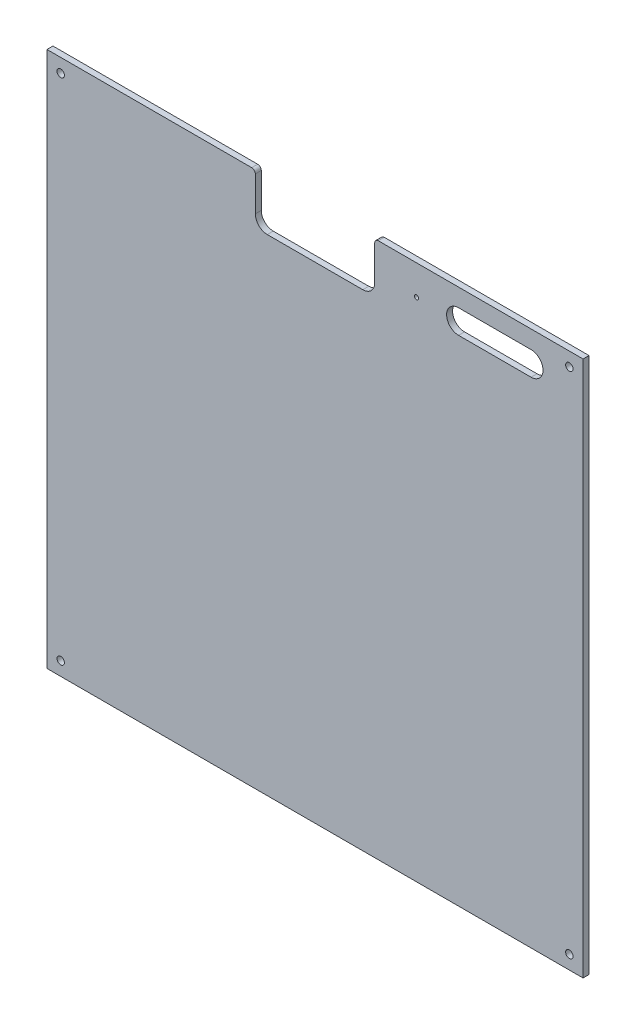
ISO-10303-21;
HEADER;
FILE_DESCRIPTION(('STEP AP214'),'2;1');
FILE_NAME('part.step','',(''),(''),'','','');
FILE_SCHEMA(('AUTOMOTIVE_DESIGN { 1 0 10303 214 1 1 1 1 }'));
ENDSEC;
DATA;
#1=APPLICATION_CONTEXT('core data for automotive mechanical design processes');
#2=APPLICATION_PROTOCOL_DEFINITION('international standard','automotive_design',2000,#1);
#3=PRODUCT_CONTEXT('',#1,'mechanical');
#4=PRODUCT('Part','Part','',(#3));
#5=PRODUCT_RELATED_PRODUCT_CATEGORY('part','',(#4));
#6=PRODUCT_DEFINITION_FORMATION('','',#4);
#7=PRODUCT_DEFINITION_CONTEXT('part definition',#1,'design');
#8=PRODUCT_DEFINITION('design','',#6,#7);
#9=PRODUCT_DEFINITION_SHAPE('','',#8);
#10=(LENGTH_UNIT() NAMED_UNIT(*) SI_UNIT(.MILLI.,.METRE.));
#11=(NAMED_UNIT(*) PLANE_ANGLE_UNIT() SI_UNIT($,.RADIAN.));
#12=(NAMED_UNIT(*) SI_UNIT($,.STERADIAN.) SOLID_ANGLE_UNIT());
#13=UNCERTAINTY_MEASURE_WITH_UNIT(LENGTH_MEASURE(1.E-05),#10,'distance_accuracy_value','');
#14=(GEOMETRIC_REPRESENTATION_CONTEXT(3) GLOBAL_UNCERTAINTY_ASSIGNED_CONTEXT((#13)) GLOBAL_UNIT_ASSIGNED_CONTEXT((#10,
#11,#12)) REPRESENTATION_CONTEXT('',''));
#15=CARTESIAN_POINT('',(0.,0.,0.));
#16=DIRECTION('',(0.,0.,1.));
#17=DIRECTION('',(1.,0.,0.));
#18=AXIS2_PLACEMENT_3D('',#15,#16,#17);
#19=CARTESIAN_POINT('',(171.5,446.,5.));
#20=DIRECTION('',(0.,0.,1.));
#21=DIRECTION('',(1.,0.,0.));
#22=AXIS2_PLACEMENT_3D('',#19,#20,#21);
#23=PLANE('',#22);
#24=DIRECTION('',(1.,0.,0.));
#25=VECTOR('',#24,1.);
#26=CARTESIAN_POINT('',(344.715899344631,414.,5.));
#27=LINE('',#26,#25);
#28=CARTESIAN_POINT('',(344.715899344631,414.,5.));
#29=VERTEX_POINT('',#28);
#30=CARTESIAN_POINT('',(405.440355678252,414.,5.));
#31=VERTEX_POINT('',#30);
#32=EDGE_CURVE('E175',#29,#31,#27,.T.);
#33=ORIENTED_EDGE('',*,*,#32,.F.);
#34=CARTESIAN_POINT('',(344.715899344631,424.,5.));
#35=DIRECTION('',(0.,0.,1.));
#36=DIRECTION('',(1.,0.,0.));
#37=AXIS2_PLACEMENT_3D('',#34,#35,#36);
#38=CIRCLE('',#37,9.99999999999995);
#39=CARTESIAN_POINT('',(344.715899344631,434.,5.));
#40=VERTEX_POINT('',#39);
#41=EDGE_CURVE('E166',#40,#29,#38,.T.);
#42=ORIENTED_EDGE('',*,*,#41,.F.);
#43=DIRECTION('',(-1.,0.,0.));
#44=VECTOR('',#43,1.);
#45=CARTESIAN_POINT('',(344.715899344631,434.,5.));
#46=LINE('',#45,#44);
#47=CARTESIAN_POINT('',(405.440355678252,434.,5.));
#48=VERTEX_POINT('',#47);
#49=EDGE_CURVE('E192',#48,#40,#46,.T.);
#50=ORIENTED_EDGE('',*,*,#49,.F.);
#51=CARTESIAN_POINT('',(405.440355678252,424.,5.));
#52=DIRECTION('',(0.,0.,1.));
#53=DIRECTION('',(1.,0.,0.));
#54=AXIS2_PLACEMENT_3D('',#51,#52,#53);
#55=CIRCLE('',#54,9.99999999999995);
#56=EDGE_CURVE('E188',#31,#48,#55,.T.);
#57=ORIENTED_EDGE('',*,*,#56,.F.);
#58=EDGE_LOOP('',(#33,#42,#50,#57));
#59=FACE_BOUND('',#58,.T.);
#60=CARTESIAN_POINT('',(11.5,437.5,5.));
#61=DIRECTION('',(0.,0.,1.));
#62=DIRECTION('',(-1.,0.,0.));
#63=AXIS2_PLACEMENT_3D('',#60,#61,#62);
#64=CIRCLE('',#63,3.1);
#65=CARTESIAN_POINT('',(8.4,437.5,5.));
#66=VERTEX_POINT('',#65);
#67=EDGE_CURVE('E339',#66,#66,#64,.T.);
#68=ORIENTED_EDGE('',*,*,#67,.F.);
#69=EDGE_LOOP('',(#68));
#70=FACE_BOUND('',#69,.T.);
#71=CARTESIAN_POINT('',(437.5,11.5,5.));
#72=DIRECTION('',(0.,0.,1.));
#73=DIRECTION('',(-1.,0.,0.));
#74=AXIS2_PLACEMENT_3D('',#71,#72,#73);
#75=CIRCLE('',#74,3.09999999999999);
#76=CARTESIAN_POINT('',(434.4,11.5,5.));
#77=VERTEX_POINT('',#76);
#78=EDGE_CURVE('E327',#77,#77,#75,.T.);
#79=ORIENTED_EDGE('',*,*,#78,.F.);
#80=EDGE_LOOP('',(#79));
#81=FACE_BOUND('',#80,.T.);
#82=DIRECTION('',(1.,0.,0.));
#83=VECTOR('',#82,1.);
#84=CARTESIAN_POINT('',(449.,0.,5.));
#85=LINE('',#84,#83);
#86=CARTESIAN_POINT('',(0.,0.,5.));
#87=VERTEX_POINT('',#86);
#88=CARTESIAN_POINT('',(449.,0.,5.));
#89=VERTEX_POINT('',#88);
#90=EDGE_CURVE('E262',#87,#89,#85,.T.);
#91=ORIENTED_EDGE('',*,*,#90,.T.);
#92=DIRECTION('',(0.,1.,0.));
#93=VECTOR('',#92,1.);
#94=CARTESIAN_POINT('',(449.,449.,5.));
#95=LINE('',#94,#93);
#96=CARTESIAN_POINT('',(449.,449.,5.));
#97=VERTEX_POINT('',#96);
#98=EDGE_CURVE('E320',#89,#97,#95,.T.);
#99=ORIENTED_EDGE('',*,*,#98,.T.);
#100=DIRECTION('',(-1.,0.,0.));
#101=VECTOR('',#100,1.);
#102=CARTESIAN_POINT('',(277.5,449.,5.));
#103=LINE('',#102,#101);
#104=CARTESIAN_POINT('',(277.5,449.,5.));
#105=VERTEX_POINT('',#104);
#106=EDGE_CURVE('E298',#97,#105,#103,.T.);
#107=ORIENTED_EDGE('',*,*,#106,.T.);
#108=CARTESIAN_POINT('',(277.5,446.,5.));
#109=DIRECTION('',(0.,0.,1.));
#110=DIRECTION('',(1.,0.,0.));
#111=AXIS2_PLACEMENT_3D('',#108,#109,#110);
#112=CIRCLE('',#111,3.);
#113=CARTESIAN_POINT('',(274.5,446.,5.));
#114=VERTEX_POINT('',#113);
#115=EDGE_CURVE('E213',#105,#114,#112,.T.);
#116=ORIENTED_EDGE('',*,*,#115,.T.);
#117=DIRECTION('',(0.,-1.,0.));
#118=VECTOR('',#117,1.);
#119=CARTESIAN_POINT('',(274.5,417.,5.));
#120=LINE('',#119,#118);
#121=CARTESIAN_POINT('',(274.5,417.,5.));
#122=VERTEX_POINT('',#121);
#123=EDGE_CURVE('E208',#114,#122,#120,.T.);
#124=ORIENTED_EDGE('',*,*,#123,.T.);
#125=CARTESIAN_POINT('',(264.5,417.,5.));
#126=DIRECTION('',(0.,0.,-1.));
#127=DIRECTION('',(-1.,0.,0.));
#128=AXIS2_PLACEMENT_3D('',#125,#126,#127);
#129=CIRCLE('',#128,10.);
#130=CARTESIAN_POINT('',(264.5,407.,5.));
#131=VERTEX_POINT('',#130);
#132=EDGE_CURVE('E212',#122,#131,#129,.T.);
#133=ORIENTED_EDGE('',*,*,#132,.T.);
#134=DIRECTION('',(-1.,0.,0.));
#135=VECTOR('',#134,1.);
#136=CARTESIAN_POINT('',(184.5,407.,5.));
#137=LINE('',#136,#135);
#138=CARTESIAN_POINT('',(184.5,407.,5.));
#139=VERTEX_POINT('',#138);
#140=EDGE_CURVE('E218',#131,#139,#137,.T.);
#141=ORIENTED_EDGE('',*,*,#140,.T.);
#142=CARTESIAN_POINT('',(184.5,417.,5.));
#143=DIRECTION('',(0.,0.,-1.));
#144=DIRECTION('',(1.,0.,0.));
#145=AXIS2_PLACEMENT_3D('',#142,#143,#144);
#146=CIRCLE('',#145,10.);
#147=CARTESIAN_POINT('',(174.5,417.,5.));
#148=VERTEX_POINT('',#147);
#149=EDGE_CURVE('E222',#139,#148,#146,.T.);
#150=ORIENTED_EDGE('',*,*,#149,.T.);
#151=DIRECTION('',(0.,1.,0.));
#152=VECTOR('',#151,1.);
#153=CARTESIAN_POINT('',(174.5,446.,5.));
#154=LINE('',#153,#152);
#155=CARTESIAN_POINT('',(174.5,446.,5.));
#156=VERTEX_POINT('',#155);
#157=EDGE_CURVE('E225',#148,#156,#154,.T.);
#158=ORIENTED_EDGE('',*,*,#157,.T.);
#159=CARTESIAN_POINT('',(171.5,446.,5.));
#160=DIRECTION('',(0.,0.,1.));
#161=DIRECTION('',(1.,0.,0.));
#162=AXIS2_PLACEMENT_3D('',#159,#160,#161);
#163=CIRCLE('',#162,2.99999999999998);
#164=CARTESIAN_POINT('',(171.5,449.,5.));
#165=VERTEX_POINT('',#164);
#166=EDGE_CURVE('E229',#156,#165,#163,.T.);
#167=ORIENTED_EDGE('',*,*,#166,.T.);
#168=DIRECTION('',(-1.,0.,0.));
#169=VECTOR('',#168,1.);
#170=CARTESIAN_POINT('',(0.,449.,5.));
#171=LINE('',#170,#169);
#172=CARTESIAN_POINT('',(0.,449.,5.));
#173=VERTEX_POINT('',#172);
#174=EDGE_CURVE('E231',#165,#173,#171,.T.);
#175=ORIENTED_EDGE('',*,*,#174,.T.);
#176=DIRECTION('',(0.,-1.,0.));
#177=VECTOR('',#176,1.);
#178=CARTESIAN_POINT('',(0.,0.,5.));
#179=LINE('',#178,#177);
#180=EDGE_CURVE('E233',#173,#87,#179,.T.);
#181=ORIENTED_EDGE('',*,*,#180,.T.);
#182=EDGE_LOOP('',(#91,#99,#107,#116,#124,#133,#141,#150,#158,#167,#175,#181));
#183=FACE_BOUND('',#182,.T.);
#184=CARTESIAN_POINT('',(11.5,11.5,5.));
#185=DIRECTION('',(0.,0.,1.));
#186=DIRECTION('',(1.,0.,0.));
#187=AXIS2_PLACEMENT_3D('',#184,#185,#186);
#188=CIRCLE('',#187,3.1);
#189=CARTESIAN_POINT('',(14.6,11.5,5.));
#190=VERTEX_POINT('',#189);
#191=EDGE_CURVE('E240',#190,#190,#188,.T.);
#192=ORIENTED_EDGE('',*,*,#191,.F.);
#193=EDGE_LOOP('',(#192));
#194=FACE_BOUND('',#193,.T.);
#195=CARTESIAN_POINT('',(437.5,437.5,5.));
#196=DIRECTION('',(0.,0.,1.));
#197=DIRECTION('',(1.,0.,0.));
#198=AXIS2_PLACEMENT_3D('',#195,#196,#197);
#199=CIRCLE('',#198,3.09999999999999);
#200=CARTESIAN_POINT('',(440.6,437.5,5.));
#201=VERTEX_POINT('',#200);
#202=EDGE_CURVE('E333',#201,#201,#199,.T.);
#203=ORIENTED_EDGE('',*,*,#202,.F.);
#204=EDGE_LOOP('',(#203));
#205=FACE_BOUND('',#204,.T.);
#206=CARTESIAN_POINT('',(309.5,424.,5.));
#207=DIRECTION('',(0.,0.,1.));
#208=DIRECTION('',(1.,0.,0.));
#209=AXIS2_PLACEMENT_3D('',#206,#207,#208);
#210=CIRCLE('',#209,1.74999999999998);
#211=CARTESIAN_POINT('',(311.25,424.,5.));
#212=VERTEX_POINT('',#211);
#213=EDGE_CURVE('E362',#212,#212,#210,.T.);
#214=ORIENTED_EDGE('',*,*,#213,.F.);
#215=EDGE_LOOP('',(#214));
#216=FACE_BOUND('',#215,.T.);
#217=ADVANCED_FACE('F42',(#59,#70,#81,#183,#194,#205,#216),#23,.T.);
#218=CARTESIAN_POINT('',(171.5,446.,0.));
#219=DIRECTION('',(0.,0.,1.));
#220=DIRECTION('',(1.,0.,0.));
#221=AXIS2_PLACEMENT_3D('',#218,#219,#220);
#222=PLANE('',#221);
#223=CARTESIAN_POINT('',(11.5,437.5,0.));
#224=DIRECTION('',(0.,0.,1.));
#225=DIRECTION('',(-1.,0.,0.));
#226=AXIS2_PLACEMENT_3D('',#223,#224,#225);
#227=CIRCLE('',#226,3.1);
#228=CARTESIAN_POINT('',(8.4,437.5,0.));
#229=VERTEX_POINT('',#228);
#230=EDGE_CURVE('E183',#229,#229,#227,.T.);
#231=ORIENTED_EDGE('',*,*,#230,.T.);
#232=EDGE_LOOP('',(#231));
#233=FACE_BOUND('',#232,.T.);
#234=CARTESIAN_POINT('',(437.5,437.5,0.));
#235=DIRECTION('',(0.,0.,1.));
#236=DIRECTION('',(1.,0.,0.));
#237=AXIS2_PLACEMENT_3D('',#234,#235,#236);
#238=CIRCLE('',#237,3.09999999999999);
#239=CARTESIAN_POINT('',(440.6,437.5,0.));
#240=VERTEX_POINT('',#239);
#241=EDGE_CURVE('E336',#240,#240,#238,.T.);
#242=ORIENTED_EDGE('',*,*,#241,.T.);
#243=EDGE_LOOP('',(#242));
#244=FACE_BOUND('',#243,.T.);
#245=CARTESIAN_POINT('',(437.5,11.5,0.));
#246=DIRECTION('',(0.,0.,1.));
#247=DIRECTION('',(-1.,0.,0.));
#248=AXIS2_PLACEMENT_3D('',#245,#246,#247);
#249=CIRCLE('',#248,3.09999999999999);
#250=CARTESIAN_POINT('',(434.4,11.5,0.));
#251=VERTEX_POINT('',#250);
#252=EDGE_CURVE('E330',#251,#251,#249,.T.);
#253=ORIENTED_EDGE('',*,*,#252,.T.);
#254=EDGE_LOOP('',(#253));
#255=FACE_BOUND('',#254,.T.);
#256=CARTESIAN_POINT('',(11.5,11.5,0.));
#257=DIRECTION('',(0.,0.,1.));
#258=DIRECTION('',(1.,0.,0.));
#259=AXIS2_PLACEMENT_3D('',#256,#257,#258);
#260=CIRCLE('',#259,3.1);
#261=CARTESIAN_POINT('',(14.6,11.5,0.));
#262=VERTEX_POINT('',#261);
#263=EDGE_CURVE('E324',#262,#262,#260,.T.);
#264=ORIENTED_EDGE('',*,*,#263,.T.);
#265=EDGE_LOOP('',(#264));
#266=FACE_BOUND('',#265,.T.);
#267=DIRECTION('',(1.,0.,0.));
#268=VECTOR('',#267,1.);
#269=CARTESIAN_POINT('',(449.,0.,0.));
#270=LINE('',#269,#268);
#271=CARTESIAN_POINT('',(0.,0.,0.));
#272=VERTEX_POINT('',#271);
#273=CARTESIAN_POINT('',(449.,0.,0.));
#274=VERTEX_POINT('',#273);
#275=EDGE_CURVE('E236',#272,#274,#270,.T.);
#276=ORIENTED_EDGE('',*,*,#275,.F.);
#277=DIRECTION('',(0.,-1.,0.));
#278=VECTOR('',#277,1.);
#279=CARTESIAN_POINT('',(0.,0.,0.));
#280=LINE('',#279,#278);
#281=CARTESIAN_POINT('',(0.,449.,0.));
#282=VERTEX_POINT('',#281);
#283=EDGE_CURVE('E260',#282,#272,#280,.T.);
#284=ORIENTED_EDGE('',*,*,#283,.F.);
#285=DIRECTION('',(-1.,0.,0.));
#286=VECTOR('',#285,1.);
#287=CARTESIAN_POINT('',(0.,449.,0.));
#288=LINE('',#287,#286);
#289=CARTESIAN_POINT('',(171.5,449.,0.));
#290=VERTEX_POINT('',#289);
#291=EDGE_CURVE('E258',#290,#282,#288,.T.);
#292=ORIENTED_EDGE('',*,*,#291,.F.);
#293=CARTESIAN_POINT('',(171.5,446.,0.));
#294=DIRECTION('',(0.,0.,1.));
#295=DIRECTION('',(1.,0.,0.));
#296=AXIS2_PLACEMENT_3D('',#293,#294,#295);
#297=CIRCLE('',#296,2.99999999999998);
#298=CARTESIAN_POINT('',(174.5,446.,0.));
#299=VERTEX_POINT('',#298);
#300=EDGE_CURVE('E256',#299,#290,#297,.T.);
#301=ORIENTED_EDGE('',*,*,#300,.F.);
#302=DIRECTION('',(0.,1.,0.));
#303=VECTOR('',#302,1.);
#304=CARTESIAN_POINT('',(174.5,446.,0.));
#305=LINE('',#304,#303);
#306=CARTESIAN_POINT('',(174.5,417.,0.));
#307=VERTEX_POINT('',#306);
#308=EDGE_CURVE('E254',#307,#299,#305,.T.);
#309=ORIENTED_EDGE('',*,*,#308,.F.);
#310=CARTESIAN_POINT('',(184.5,417.,0.));
#311=DIRECTION('',(0.,0.,-1.));
#312=DIRECTION('',(1.,0.,0.));
#313=AXIS2_PLACEMENT_3D('',#310,#311,#312);
#314=CIRCLE('',#313,10.);
#315=CARTESIAN_POINT('',(184.5,407.,0.));
#316=VERTEX_POINT('',#315);
#317=EDGE_CURVE('E252',#316,#307,#314,.T.);
#318=ORIENTED_EDGE('',*,*,#317,.F.);
#319=DIRECTION('',(-1.,0.,0.));
#320=VECTOR('',#319,1.);
#321=CARTESIAN_POINT('',(184.5,407.,0.));
#322=LINE('',#321,#320);
#323=CARTESIAN_POINT('',(264.5,407.,0.));
#324=VERTEX_POINT('',#323);
#325=EDGE_CURVE('E250',#324,#316,#322,.T.);
#326=ORIENTED_EDGE('',*,*,#325,.F.);
#327=CARTESIAN_POINT('',(264.5,417.,0.));
#328=DIRECTION('',(0.,0.,-1.));
#329=DIRECTION('',(-1.,0.,0.));
#330=AXIS2_PLACEMENT_3D('',#327,#328,#329);
#331=CIRCLE('',#330,10.);
#332=CARTESIAN_POINT('',(274.5,417.,0.));
#333=VERTEX_POINT('',#332);
#334=EDGE_CURVE('E248',#333,#324,#331,.T.);
#335=ORIENTED_EDGE('',*,*,#334,.F.);
#336=DIRECTION('',(0.,-1.,0.));
#337=VECTOR('',#336,1.);
#338=CARTESIAN_POINT('',(274.5,417.,0.));
#339=LINE('',#338,#337);
#340=CARTESIAN_POINT('',(274.5,446.,0.));
#341=VERTEX_POINT('',#340);
#342=EDGE_CURVE('E246',#341,#333,#339,.T.);
#343=ORIENTED_EDGE('',*,*,#342,.F.);
#344=CARTESIAN_POINT('',(277.5,446.,0.));
#345=DIRECTION('',(0.,0.,1.));
#346=DIRECTION('',(1.,0.,0.));
#347=AXIS2_PLACEMENT_3D('',#344,#345,#346);
#348=CIRCLE('',#347,3.);
#349=CARTESIAN_POINT('',(277.5,449.,0.));
#350=VERTEX_POINT('',#349);
#351=EDGE_CURVE('E244',#350,#341,#348,.T.);
#352=ORIENTED_EDGE('',*,*,#351,.F.);
#353=DIRECTION('',(-1.,0.,0.));
#354=VECTOR('',#353,1.);
#355=CARTESIAN_POINT('',(277.5,449.,0.));
#356=LINE('',#355,#354);
#357=CARTESIAN_POINT('',(449.,449.,0.));
#358=VERTEX_POINT('',#357);
#359=EDGE_CURVE('E242',#358,#350,#356,.T.);
#360=ORIENTED_EDGE('',*,*,#359,.F.);
#361=DIRECTION('',(0.,1.,0.));
#362=VECTOR('',#361,1.);
#363=CARTESIAN_POINT('',(449.,449.,0.));
#364=LINE('',#363,#362);
#365=EDGE_CURVE('E239',#274,#358,#364,.T.);
#366=ORIENTED_EDGE('',*,*,#365,.F.);
#367=EDGE_LOOP('',(#276,#284,#292,#301,#309,#318,#326,#335,#343,#352,#360,#366));
#368=FACE_BOUND('',#367,.T.);
#369=CARTESIAN_POINT('',(344.715899344631,424.,0.));
#370=DIRECTION('',(0.,0.,1.));
#371=DIRECTION('',(1.,0.,0.));
#372=AXIS2_PLACEMENT_3D('',#369,#370,#371);
#373=CIRCLE('',#372,9.99999999999995);
#374=CARTESIAN_POINT('',(344.715899344631,434.,0.));
#375=VERTEX_POINT('',#374);
#376=CARTESIAN_POINT('',(344.715899344631,414.,0.));
#377=VERTEX_POINT('',#376);
#378=EDGE_CURVE('E68',#375,#377,#373,.T.);
#379=ORIENTED_EDGE('',*,*,#378,.T.);
#380=DIRECTION('',(1.,0.,0.));
#381=VECTOR('',#380,1.);
#382=CARTESIAN_POINT('',(344.715899344631,414.,0.));
#383=LINE('',#382,#381);
#384=CARTESIAN_POINT('',(405.440355678252,414.,0.));
#385=VERTEX_POINT('',#384);
#386=EDGE_CURVE('E182',#377,#385,#383,.T.);
#387=ORIENTED_EDGE('',*,*,#386,.T.);
#388=CARTESIAN_POINT('',(405.440355678252,424.,0.));
#389=DIRECTION('',(0.,0.,1.));
#390=DIRECTION('',(1.,0.,0.));
#391=AXIS2_PLACEMENT_3D('',#388,#389,#390);
#392=CIRCLE('',#391,9.99999999999995);
#393=CARTESIAN_POINT('',(405.440355678252,434.,0.));
#394=VERTEX_POINT('',#393);
#395=EDGE_CURVE('E358',#385,#394,#392,.T.);
#396=ORIENTED_EDGE('',*,*,#395,.T.);
#397=DIRECTION('',(-1.,0.,0.));
#398=VECTOR('',#397,1.);
#399=CARTESIAN_POINT('',(344.715899344631,434.,0.));
#400=LINE('',#399,#398);
#401=EDGE_CURVE('E176',#394,#375,#400,.T.);
#402=ORIENTED_EDGE('',*,*,#401,.T.);
#403=EDGE_LOOP('',(#379,#387,#396,#402));
#404=FACE_BOUND('',#403,.T.);
#405=CARTESIAN_POINT('',(309.5,424.,0.));
#406=DIRECTION('',(0.,0.,1.));
#407=DIRECTION('',(1.,0.,0.));
#408=AXIS2_PLACEMENT_3D('',#405,#406,#407);
#409=CIRCLE('',#408,1.74999999999998);
#410=CARTESIAN_POINT('',(311.25,424.,0.));
#411=VERTEX_POINT('',#410);
#412=EDGE_CURVE('E592',#411,#411,#409,.T.);
#413=ORIENTED_EDGE('',*,*,#412,.T.);
#414=EDGE_LOOP('',(#413));
#415=FACE_BOUND('',#414,.T.);
#416=ADVANCED_FACE('F303',(#233,#244,#255,#266,#368,#404,#415),#222,.F.);
#417=CARTESIAN_POINT('',(449.,0.,5.));
#418=DIRECTION('',(0.,1.,0.));
#419=DIRECTION('',(0.,0.,1.));
#420=AXIS2_PLACEMENT_3D('',#417,#418,#419);
#421=PLANE('',#420);
#422=ORIENTED_EDGE('',*,*,#275,.T.);
#423=DIRECTION('',(0.,0.,-1.));
#424=VECTOR('',#423,1.);
#425=CARTESIAN_POINT('',(449.,0.,5.));
#426=LINE('',#425,#424);
#427=EDGE_CURVE('E12',#89,#274,#426,.T.);
#428=ORIENTED_EDGE('',*,*,#427,.F.);
#429=ORIENTED_EDGE('',*,*,#90,.F.);
#430=DIRECTION('',(0.,0.,-1.));
#431=VECTOR('',#430,1.);
#432=CARTESIAN_POINT('',(0.,0.,5.));
#433=LINE('',#432,#431);
#434=EDGE_CURVE('E235',#87,#272,#433,.T.);
#435=ORIENTED_EDGE('',*,*,#434,.T.);
#436=EDGE_LOOP('',(#422,#428,#429,#435));
#437=FACE_BOUND('',#436,.T.);
#438=ADVANCED_FACE('F44',(#437),#421,.F.);
#439=CARTESIAN_POINT('',(449.,449.,5.));
#440=DIRECTION('',(-1.,0.,0.));
#441=DIRECTION('',(0.,-1.,0.));
#442=AXIS2_PLACEMENT_3D('',#439,#440,#441);
#443=PLANE('',#442);
#444=ORIENTED_EDGE('',*,*,#365,.T.);
#445=DIRECTION('',(0.,0.,-1.));
#446=VECTOR('',#445,1.);
#447=CARTESIAN_POINT('',(449.,449.,5.));
#448=LINE('',#447,#446);
#449=EDGE_CURVE('E50',#97,#358,#448,.T.);
#450=ORIENTED_EDGE('',*,*,#449,.F.);
#451=ORIENTED_EDGE('',*,*,#98,.F.);
#452=ORIENTED_EDGE('',*,*,#427,.T.);
#453=EDGE_LOOP('',(#444,#450,#451,#452));
#454=FACE_BOUND('',#453,.T.);
#455=ADVANCED_FACE('F424',(#454),#443,.F.);
#456=CARTESIAN_POINT('',(277.5,449.,5.));
#457=DIRECTION('',(0.,-1.,0.));
#458=DIRECTION('',(0.,0.,-1.));
#459=AXIS2_PLACEMENT_3D('',#456,#457,#458);
#460=PLANE('',#459);
#461=ORIENTED_EDGE('',*,*,#359,.T.);
#462=DIRECTION('',(0.,0.,-1.));
#463=VECTOR('',#462,1.);
#464=CARTESIAN_POINT('',(277.5,449.,5.));
#465=LINE('',#464,#463);
#466=EDGE_CURVE('E289',#105,#350,#465,.T.);
#467=ORIENTED_EDGE('',*,*,#466,.F.);
#468=ORIENTED_EDGE('',*,*,#106,.F.);
#469=ORIENTED_EDGE('',*,*,#449,.T.);
#470=EDGE_LOOP('',(#461,#467,#468,#469));
#471=FACE_BOUND('',#470,.T.);
#472=ADVANCED_FACE('F296',(#471),#460,.F.);
#473=CARTESIAN_POINT('',(277.5,446.,5.));
#474=DIRECTION('',(0.,0.,-1.));
#475=DIRECTION('',(-1.,0.,0.));
#476=AXIS2_PLACEMENT_3D('',#473,#474,#475);
#477=CYLINDRICAL_SURFACE('',#476,3.);
#478=ORIENTED_EDGE('',*,*,#351,.T.);
#479=DIRECTION('',(0.,0.,-1.));
#480=VECTOR('',#479,1.);
#481=CARTESIAN_POINT('',(274.5,446.,5.));
#482=LINE('',#481,#480);
#483=EDGE_CURVE('E286',#114,#341,#482,.T.);
#484=ORIENTED_EDGE('',*,*,#483,.F.);
#485=ORIENTED_EDGE('',*,*,#115,.F.);
#486=ORIENTED_EDGE('',*,*,#466,.T.);
#487=EDGE_LOOP('',(#478,#484,#485,#486));
#488=FACE_BOUND('',#487,.T.);
#489=ADVANCED_FACE('F309',(#488),#477,.T.);
#490=CARTESIAN_POINT('',(274.5,417.,5.));
#491=DIRECTION('',(1.,0.,0.));
#492=DIRECTION('',(0.,1.,0.));
#493=AXIS2_PLACEMENT_3D('',#490,#491,#492);
#494=PLANE('',#493);
#495=ORIENTED_EDGE('',*,*,#342,.T.);
#496=DIRECTION('',(0.,0.,-1.));
#497=VECTOR('',#496,1.);
#498=CARTESIAN_POINT('',(274.5,417.,5.));
#499=LINE('',#498,#497);
#500=EDGE_CURVE('E283',#122,#333,#499,.T.);
#501=ORIENTED_EDGE('',*,*,#500,.F.);
#502=ORIENTED_EDGE('',*,*,#123,.F.);
#503=ORIENTED_EDGE('',*,*,#483,.T.);
#504=EDGE_LOOP('',(#495,#501,#502,#503));
#505=FACE_BOUND('',#504,.T.);
#506=ADVANCED_FACE('F313',(#505),#494,.F.);
#507=CARTESIAN_POINT('',(264.5,417.,5.));
#508=DIRECTION('',(0.,0.,-1.));
#509=DIRECTION('',(-1.,0.,0.));
#510=AXIS2_PLACEMENT_3D('',#507,#508,#509);
#511=CYLINDRICAL_SURFACE('',#510,10.);
#512=ORIENTED_EDGE('',*,*,#334,.T.);
#513=DIRECTION('',(0.,0.,-1.));
#514=VECTOR('',#513,1.);
#515=CARTESIAN_POINT('',(264.5,407.,5.));
#516=LINE('',#515,#514);
#517=EDGE_CURVE('E280',#131,#324,#516,.T.);
#518=ORIENTED_EDGE('',*,*,#517,.F.);
#519=ORIENTED_EDGE('',*,*,#132,.F.);
#520=ORIENTED_EDGE('',*,*,#500,.T.);
#521=EDGE_LOOP('',(#512,#518,#519,#520));
#522=FACE_BOUND('',#521,.T.);
#523=ADVANCED_FACE('F414',(#522),#511,.F.);
#524=CARTESIAN_POINT('',(184.5,407.,5.));
#525=DIRECTION('',(0.,-1.,0.));
#526=DIRECTION('',(0.,0.,-1.));
#527=AXIS2_PLACEMENT_3D('',#524,#525,#526);
#528=PLANE('',#527);
#529=ORIENTED_EDGE('',*,*,#325,.T.);
#530=DIRECTION('',(0.,0.,-1.));
#531=VECTOR('',#530,1.);
#532=CARTESIAN_POINT('',(184.5,407.,5.));
#533=LINE('',#532,#531);
#534=EDGE_CURVE('E277',#139,#316,#533,.T.);
#535=ORIENTED_EDGE('',*,*,#534,.F.);
#536=ORIENTED_EDGE('',*,*,#140,.F.);
#537=ORIENTED_EDGE('',*,*,#517,.T.);
#538=EDGE_LOOP('',(#529,#535,#536,#537));
#539=FACE_BOUND('',#538,.T.);
#540=ADVANCED_FACE('F410',(#539),#528,.F.);
#541=CARTESIAN_POINT('',(184.5,417.,5.));
#542=DIRECTION('',(0.,0.,-1.));
#543=DIRECTION('',(-1.,0.,0.));
#544=AXIS2_PLACEMENT_3D('',#541,#542,#543);
#545=CYLINDRICAL_SURFACE('',#544,10.);
#546=ORIENTED_EDGE('',*,*,#317,.T.);
#547=DIRECTION('',(0.,0.,-1.));
#548=VECTOR('',#547,1.);
#549=CARTESIAN_POINT('',(174.5,417.,5.));
#550=LINE('',#549,#548);
#551=EDGE_CURVE('E274',#148,#307,#550,.T.);
#552=ORIENTED_EDGE('',*,*,#551,.F.);
#553=ORIENTED_EDGE('',*,*,#149,.F.);
#554=ORIENTED_EDGE('',*,*,#534,.T.);
#555=EDGE_LOOP('',(#546,#552,#553,#554));
#556=FACE_BOUND('',#555,.T.);
#557=ADVANCED_FACE('F406',(#556),#545,.F.);
#558=CARTESIAN_POINT('',(174.5,446.,5.));
#559=DIRECTION('',(-1.,0.,0.));
#560=DIRECTION('',(0.,-1.,0.));
#561=AXIS2_PLACEMENT_3D('',#558,#559,#560);
#562=PLANE('',#561);
#563=ORIENTED_EDGE('',*,*,#308,.T.);
#564=DIRECTION('',(0.,0.,-1.));
#565=VECTOR('',#564,1.);
#566=CARTESIAN_POINT('',(174.5,446.,5.));
#567=LINE('',#566,#565);
#568=EDGE_CURVE('E271',#156,#299,#567,.T.);
#569=ORIENTED_EDGE('',*,*,#568,.F.);
#570=ORIENTED_EDGE('',*,*,#157,.F.);
#571=ORIENTED_EDGE('',*,*,#551,.T.);
#572=EDGE_LOOP('',(#563,#569,#570,#571));
#573=FACE_BOUND('',#572,.T.);
#574=ADVANCED_FACE('F402',(#573),#562,.F.);
#575=CARTESIAN_POINT('',(171.5,446.,5.));
#576=DIRECTION('',(0.,0.,-1.));
#577=DIRECTION('',(-1.,0.,0.));
#578=AXIS2_PLACEMENT_3D('',#575,#576,#577);
#579=CYLINDRICAL_SURFACE('',#578,2.99999999999998);
#580=ORIENTED_EDGE('',*,*,#300,.T.);
#581=DIRECTION('',(0.,0.,-1.));
#582=VECTOR('',#581,1.);
#583=CARTESIAN_POINT('',(171.5,449.,5.));
#584=LINE('',#583,#582);
#585=EDGE_CURVE('E268',#165,#290,#584,.T.);
#586=ORIENTED_EDGE('',*,*,#585,.F.);
#587=ORIENTED_EDGE('',*,*,#166,.F.);
#588=ORIENTED_EDGE('',*,*,#568,.T.);
#589=EDGE_LOOP('',(#580,#586,#587,#588));
#590=FACE_BOUND('',#589,.T.);
#591=ADVANCED_FACE('F398',(#590),#579,.T.);
#592=CARTESIAN_POINT('',(0.,449.,5.));
#593=DIRECTION('',(0.,-1.,0.));
#594=DIRECTION('',(0.,0.,-1.));
#595=AXIS2_PLACEMENT_3D('',#592,#593,#594);
#596=PLANE('',#595);
#597=ORIENTED_EDGE('',*,*,#291,.T.);
#598=DIRECTION('',(0.,0.,-1.));
#599=VECTOR('',#598,1.);
#600=CARTESIAN_POINT('',(0.,449.,5.));
#601=LINE('',#600,#599);
#602=EDGE_CURVE('E265',#173,#282,#601,.T.);
#603=ORIENTED_EDGE('',*,*,#602,.F.);
#604=ORIENTED_EDGE('',*,*,#174,.F.);
#605=ORIENTED_EDGE('',*,*,#585,.T.);
#606=EDGE_LOOP('',(#597,#603,#604,#605));
#607=FACE_BOUND('',#606,.T.);
#608=ADVANCED_FACE('F394',(#607),#596,.F.);
#609=CARTESIAN_POINT('',(0.,0.,5.));
#610=DIRECTION('',(1.,0.,0.));
#611=DIRECTION('',(0.,0.,-1.));
#612=AXIS2_PLACEMENT_3D('',#609,#610,#611);
#613=PLANE('',#612);
#614=ORIENTED_EDGE('',*,*,#283,.T.);
#615=ORIENTED_EDGE('',*,*,#434,.F.);
#616=ORIENTED_EDGE('',*,*,#180,.F.);
#617=ORIENTED_EDGE('',*,*,#602,.T.);
#618=EDGE_LOOP('',(#614,#615,#616,#617));
#619=FACE_BOUND('',#618,.T.);
#620=ADVANCED_FACE('F391',(#619),#613,.F.);
#621=CARTESIAN_POINT('',(11.5,11.5,5.));
#622=DIRECTION('',(0.,0.,-1.));
#623=DIRECTION('',(-1.,0.,0.));
#624=AXIS2_PLACEMENT_3D('',#621,#622,#623);
#625=CYLINDRICAL_SURFACE('',#624,3.1);
#626=ORIENTED_EDGE('',*,*,#191,.T.);
#627=EDGE_LOOP('',(#626));
#628=FACE_BOUND('',#627,.T.);
#629=ORIENTED_EDGE('',*,*,#263,.F.);
#630=EDGE_LOOP('',(#629));
#631=FACE_BOUND('',#630,.T.);
#632=ADVANCED_FACE('F388',(#628,#631),#625,.F.);
#633=CARTESIAN_POINT('',(437.5,11.5,5.));
#634=DIRECTION('',(0.,0.,-1.));
#635=DIRECTION('',(-1.,0.,0.));
#636=AXIS2_PLACEMENT_3D('',#633,#634,#635);
#637=CYLINDRICAL_SURFACE('',#636,3.09999999999999);
#638=ORIENTED_EDGE('',*,*,#78,.T.);
#639=EDGE_LOOP('',(#638));
#640=FACE_BOUND('',#639,.T.);
#641=ORIENTED_EDGE('',*,*,#252,.F.);
#642=EDGE_LOOP('',(#641));
#643=FACE_BOUND('',#642,.T.);
#644=ADVANCED_FACE('F529',(#640,#643),#637,.F.);
#645=CARTESIAN_POINT('',(437.5,437.5,5.));
#646=DIRECTION('',(0.,0.,-1.));
#647=DIRECTION('',(-1.,0.,0.));
#648=AXIS2_PLACEMENT_3D('',#645,#646,#647);
#649=CYLINDRICAL_SURFACE('',#648,3.09999999999999);
#650=ORIENTED_EDGE('',*,*,#202,.T.);
#651=EDGE_LOOP('',(#650));
#652=FACE_BOUND('',#651,.T.);
#653=ORIENTED_EDGE('',*,*,#241,.F.);
#654=EDGE_LOOP('',(#653));
#655=FACE_BOUND('',#654,.T.);
#656=ADVANCED_FACE('F537',(#652,#655),#649,.F.);
#657=CARTESIAN_POINT('',(11.5,437.5,5.));
#658=DIRECTION('',(0.,0.,-1.));
#659=DIRECTION('',(-1.,0.,0.));
#660=AXIS2_PLACEMENT_3D('',#657,#658,#659);
#661=CYLINDRICAL_SURFACE('',#660,3.1);
#662=ORIENTED_EDGE('',*,*,#67,.T.);
#663=EDGE_LOOP('',(#662));
#664=FACE_BOUND('',#663,.T.);
#665=ORIENTED_EDGE('',*,*,#230,.F.);
#666=EDGE_LOOP('',(#665));
#667=FACE_BOUND('',#666,.T.);
#668=ADVANCED_FACE('F545',(#664,#667),#661,.F.);
#669=CARTESIAN_POINT('',(344.715899344631,424.,5.));
#670=DIRECTION('',(0.,0.,-1.));
#671=DIRECTION('',(-1.,0.,0.));
#672=AXIS2_PLACEMENT_3D('',#669,#670,#671);
#673=CYLINDRICAL_SURFACE('',#672,9.99999999999995);
#674=ORIENTED_EDGE('',*,*,#378,.F.);
#675=DIRECTION('',(0.,0.,-1.));
#676=VECTOR('',#675,1.);
#677=CARTESIAN_POINT('',(344.715899344631,434.,5.));
#678=LINE('',#677,#676);
#679=EDGE_CURVE('E170',#40,#375,#678,.T.);
#680=ORIENTED_EDGE('',*,*,#679,.F.);
#681=ORIENTED_EDGE('',*,*,#41,.T.);
#682=DIRECTION('',(0.,0.,-1.));
#683=VECTOR('',#682,1.);
#684=CARTESIAN_POINT('',(344.715899344631,414.,5.));
#685=LINE('',#684,#683);
#686=EDGE_CURVE('E169',#29,#377,#685,.T.);
#687=ORIENTED_EDGE('',*,*,#686,.T.);
#688=EDGE_LOOP('',(#674,#680,#681,#687));
#689=FACE_BOUND('',#688,.T.);
#690=ADVANCED_FACE('F168',(#689),#673,.F.);
#691=CARTESIAN_POINT('',(344.715899344631,414.,5.));
#692=DIRECTION('',(0.,1.,0.));
#693=DIRECTION('',(0.,0.,1.));
#694=AXIS2_PLACEMENT_3D('',#691,#692,#693);
#695=PLANE('',#694);
#696=ORIENTED_EDGE('',*,*,#386,.F.);
#697=ORIENTED_EDGE('',*,*,#686,.F.);
#698=ORIENTED_EDGE('',*,*,#32,.T.);
#699=DIRECTION('',(0.,0.,-1.));
#700=VECTOR('',#699,1.);
#701=CARTESIAN_POINT('',(405.440355678252,414.,5.));
#702=LINE('',#701,#700);
#703=EDGE_CURVE('E184',#31,#385,#702,.T.);
#704=ORIENTED_EDGE('',*,*,#703,.T.);
#705=EDGE_LOOP('',(#696,#697,#698,#704));
#706=FACE_BOUND('',#705,.T.);
#707=ADVANCED_FACE('F179',(#706),#695,.T.);
#708=CARTESIAN_POINT('',(405.440355678252,424.,5.));
#709=DIRECTION('',(0.,0.,-1.));
#710=DIRECTION('',(-1.,0.,0.));
#711=AXIS2_PLACEMENT_3D('',#708,#709,#710);
#712=CYLINDRICAL_SURFACE('',#711,9.99999999999995);
#713=ORIENTED_EDGE('',*,*,#395,.F.);
#714=ORIENTED_EDGE('',*,*,#703,.F.);
#715=ORIENTED_EDGE('',*,*,#56,.T.);
#716=DIRECTION('',(0.,0.,-1.));
#717=VECTOR('',#716,1.);
#718=CARTESIAN_POINT('',(405.440355678252,434.,5.));
#719=LINE('',#718,#717);
#720=EDGE_CURVE('E60',#48,#394,#719,.T.);
#721=ORIENTED_EDGE('',*,*,#720,.T.);
#722=EDGE_LOOP('',(#713,#714,#715,#721));
#723=FACE_BOUND('',#722,.T.);
#724=ADVANCED_FACE('F370',(#723),#712,.F.);
#725=CARTESIAN_POINT('',(344.715899344631,434.,5.));
#726=DIRECTION('',(0.,-1.,0.));
#727=DIRECTION('',(0.,0.,-1.));
#728=AXIS2_PLACEMENT_3D('',#725,#726,#727);
#729=PLANE('',#728);
#730=ORIENTED_EDGE('',*,*,#401,.F.);
#731=ORIENTED_EDGE('',*,*,#720,.F.);
#732=ORIENTED_EDGE('',*,*,#49,.T.);
#733=ORIENTED_EDGE('',*,*,#679,.T.);
#734=EDGE_LOOP('',(#730,#731,#732,#733));
#735=FACE_BOUND('',#734,.T.);
#736=ADVANCED_FACE('F366',(#735),#729,.T.);
#737=CARTESIAN_POINT('',(309.5,424.,5.));
#738=DIRECTION('',(0.,0.,-1.));
#739=DIRECTION('',(-1.,0.,0.));
#740=AXIS2_PLACEMENT_3D('',#737,#738,#739);
#741=CYLINDRICAL_SURFACE('',#740,1.74999999999998);
#742=ORIENTED_EDGE('',*,*,#213,.T.);
#743=EDGE_LOOP('',(#742));
#744=FACE_BOUND('',#743,.T.);
#745=ORIENTED_EDGE('',*,*,#412,.F.);
#746=EDGE_LOOP('',(#745));
#747=FACE_BOUND('',#746,.T.);
#748=ADVANCED_FACE('F377',(#744,#747),#741,.F.);
#749=CLOSED_SHELL('',(#217,#416,#438,#455,#472,#489,#506,#523,#540,#557,#574,#591,#608,#620,
#632,#644,#656,#668,#690,#707,#724,#736,#748));
#750=MANIFOLD_SOLID_BREP('B2',#749);
#751=ADVANCED_BREP_SHAPE_REPRESENTATION('',(#18,#750),#14);
#752=SHAPE_DEFINITION_REPRESENTATION(#9,#751);
ENDSEC;
END-ISO-10303-21;
